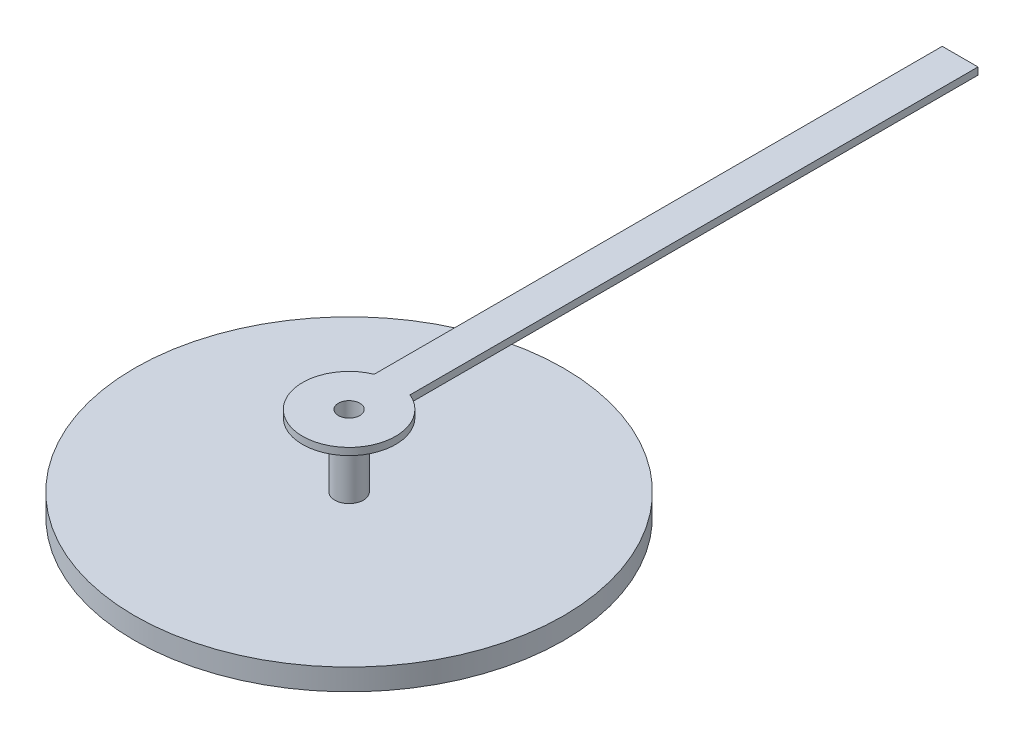
ISO-10303-21;
HEADER;
FILE_DESCRIPTION(('STEP AP214'),'2;1');
FILE_NAME('part.step','',(''),(''),'','','');
FILE_SCHEMA(('AUTOMOTIVE_DESIGN { 1 0 10303 214 1 1 1 1 }'));
ENDSEC;
DATA;
#1=APPLICATION_CONTEXT('core data for automotive mechanical design processes');
#2=APPLICATION_PROTOCOL_DEFINITION('international standard','automotive_design',2000,#1);
#3=PRODUCT_CONTEXT('',#1,'mechanical');
#4=PRODUCT('Part','Part','',(#3));
#5=PRODUCT_RELATED_PRODUCT_CATEGORY('part','',(#4));
#6=PRODUCT_DEFINITION_FORMATION('','',#4);
#7=PRODUCT_DEFINITION_CONTEXT('part definition',#1,'design');
#8=PRODUCT_DEFINITION('design','',#6,#7);
#9=PRODUCT_DEFINITION_SHAPE('','',#8);
#10=(LENGTH_UNIT() NAMED_UNIT(*) SI_UNIT(.MILLI.,.METRE.));
#11=(NAMED_UNIT(*) PLANE_ANGLE_UNIT() SI_UNIT($,.RADIAN.));
#12=(NAMED_UNIT(*) SI_UNIT($,.STERADIAN.) SOLID_ANGLE_UNIT());
#13=UNCERTAINTY_MEASURE_WITH_UNIT(LENGTH_MEASURE(1.E-05),#10,'distance_accuracy_value','');
#14=(GEOMETRIC_REPRESENTATION_CONTEXT(3) GLOBAL_UNCERTAINTY_ASSIGNED_CONTEXT((#13)) GLOBAL_UNIT_ASSIGNED_CONTEXT((#10,
#11,#12)) REPRESENTATION_CONTEXT('',''));
#15=CARTESIAN_POINT('',(0.,0.,0.));
#16=DIRECTION('',(0.,0.,1.));
#17=DIRECTION('',(1.,0.,0.));
#18=AXIS2_PLACEMENT_3D('',#15,#16,#17);
#19=CARTESIAN_POINT('',(0.,0.,0.));
#20=DIRECTION('',(0.,1.,0.));
#21=DIRECTION('',(0.,0.,1.));
#22=AXIS2_PLACEMENT_3D('',#19,#20,#21);
#23=PLANE('',#22);
#24=CARTESIAN_POINT('',(0.,0.,0.));
#25=DIRECTION('',(0.,1.,0.));
#26=DIRECTION('',(0.,0.,1.));
#27=AXIS2_PLACEMENT_3D('',#24,#25,#26);
#28=CIRCLE('',#27,0.651139848707377);
#29=CARTESIAN_POINT('',(-0.25,0.,-0.601234648514759));
#30=VERTEX_POINT('',#29);
#31=CARTESIAN_POINT('',(0.25,0.,-0.601234648514759));
#32=VERTEX_POINT('',#31);
#33=EDGE_CURVE('E104',#30,#32,#28,.T.);
#34=ORIENTED_EDGE('',*,*,#33,.F.);
#35=DIRECTION('',(0.,0.,1.));
#36=VECTOR('',#35,1.);
#37=CARTESIAN_POINT('',(-0.25,0.,-8.54543560573179));
#38=LINE('',#37,#36);
#39=CARTESIAN_POINT('',(-0.25,0.,-8.54543560573179));
#40=VERTEX_POINT('',#39);
#41=EDGE_CURVE('E77',#40,#30,#38,.T.);
#42=ORIENTED_EDGE('',*,*,#41,.F.);
#43=DIRECTION('',(-1.,0.,0.));
#44=VECTOR('',#43,1.);
#45=CARTESIAN_POINT('',(-0.25,0.,-8.54543560573179));
#46=LINE('',#45,#44);
#47=CARTESIAN_POINT('',(0.25,0.,-8.54543560573179));
#48=VERTEX_POINT('',#47);
#49=EDGE_CURVE('E71',#48,#40,#46,.T.);
#50=ORIENTED_EDGE('',*,*,#49,.F.);
#51=DIRECTION('',(0.,0.,-1.));
#52=VECTOR('',#51,1.);
#53=CARTESIAN_POINT('',(0.25,0.,-8.54543560573179));
#54=LINE('',#53,#52);
#55=EDGE_CURVE('E95',#32,#48,#54,.T.);
#56=ORIENTED_EDGE('',*,*,#55,.F.);
#57=EDGE_LOOP('',(#34,#42,#50,#56));
#58=FACE_BOUND('',#57,.T.);
#59=CARTESIAN_POINT('',(0.,0.,0.));
#60=DIRECTION('',(0.,1.,0.));
#61=DIRECTION('',(0.,0.,1.));
#62=AXIS2_PLACEMENT_3D('',#59,#60,#61);
#63=CIRCLE('',#62,0.2);
#64=CARTESIAN_POINT('',(0.,0.,0.2));
#65=VERTEX_POINT('',#64);
#66=EDGE_CURVE('E11',#65,#65,#63,.F.);
#67=ORIENTED_EDGE('',*,*,#66,.F.);
#68=EDGE_LOOP('',(#67));
#69=FACE_BOUND('',#68,.T.);
#70=ADVANCED_FACE('F37',(#58,#69),#23,.F.);
#71=CARTESIAN_POINT('',(0.,0.1,0.));
#72=DIRECTION('',(0.,-1.,0.));
#73=DIRECTION('',(0.,0.,-1.));
#74=AXIS2_PLACEMENT_3D('',#71,#72,#73);
#75=CYLINDRICAL_SURFACE('',#74,0.651139848707377);
#76=ORIENTED_EDGE('',*,*,#33,.T.);
#77=DIRECTION('',(0.,-1.,0.));
#78=VECTOR('',#77,1.);
#79=CARTESIAN_POINT('',(0.25,0.1,-0.601234648514759));
#80=LINE('',#79,#78);
#81=CARTESIAN_POINT('',(0.25,0.1,-0.601234648514759));
#82=VERTEX_POINT('',#81);
#83=EDGE_CURVE('E46',#82,#32,#80,.T.);
#84=ORIENTED_EDGE('',*,*,#83,.F.);
#85=CARTESIAN_POINT('',(0.,0.1,0.));
#86=DIRECTION('',(0.,1.,0.));
#87=DIRECTION('',(0.,0.,1.));
#88=AXIS2_PLACEMENT_3D('',#85,#86,#87);
#89=CIRCLE('',#88,0.651139848707377);
#90=CARTESIAN_POINT('',(-0.25,0.1,-0.601234648514759));
#91=VERTEX_POINT('',#90);
#92=EDGE_CURVE('E90',#91,#82,#89,.T.);
#93=ORIENTED_EDGE('',*,*,#92,.F.);
#94=DIRECTION('',(0.,-1.,0.));
#95=VECTOR('',#94,1.);
#96=CARTESIAN_POINT('',(-0.25,0.1,-0.601234648514759));
#97=LINE('',#96,#95);
#98=EDGE_CURVE('E100',#91,#30,#97,.T.);
#99=ORIENTED_EDGE('',*,*,#98,.T.);
#100=EDGE_LOOP('',(#76,#84,#93,#99));
#101=FACE_BOUND('',#100,.T.);
#102=ADVANCED_FACE('F39',(#101),#75,.T.);
#103=CARTESIAN_POINT('',(0.25,0.1,-8.54543560573179));
#104=DIRECTION('',(-1.,0.,0.));
#105=DIRECTION('',(0.,0.,1.));
#106=AXIS2_PLACEMENT_3D('',#103,#104,#105);
#107=PLANE('',#106);
#108=ORIENTED_EDGE('',*,*,#55,.T.);
#109=DIRECTION('',(0.,-1.,0.));
#110=VECTOR('',#109,1.);
#111=CARTESIAN_POINT('',(0.25,0.1,-8.54543560573179));
#112=LINE('',#111,#110);
#113=CARTESIAN_POINT('',(0.25,0.1,-8.54543560573179));
#114=VERTEX_POINT('',#113);
#115=EDGE_CURVE('E93',#114,#48,#112,.T.);
#116=ORIENTED_EDGE('',*,*,#115,.F.);
#117=DIRECTION('',(0.,0.,-1.));
#118=VECTOR('',#117,1.);
#119=CARTESIAN_POINT('',(0.25,0.1,-8.54543560573179));
#120=LINE('',#119,#118);
#121=EDGE_CURVE('E85',#82,#114,#120,.T.);
#122=ORIENTED_EDGE('',*,*,#121,.F.);
#123=ORIENTED_EDGE('',*,*,#83,.T.);
#124=EDGE_LOOP('',(#108,#116,#122,#123));
#125=FACE_BOUND('',#124,.T.);
#126=ADVANCED_FACE('F94',(#125),#107,.F.);
#127=CARTESIAN_POINT('',(-0.25,0.1,-8.54543560573179));
#128=DIRECTION('',(0.,0.,1.));
#129=DIRECTION('',(1.,0.,0.));
#130=AXIS2_PLACEMENT_3D('',#127,#128,#129);
#131=PLANE('',#130);
#132=ORIENTED_EDGE('',*,*,#49,.T.);
#133=DIRECTION('',(0.,-1.,0.));
#134=VECTOR('',#133,1.);
#135=CARTESIAN_POINT('',(-0.25,0.1,-8.54543560573179));
#136=LINE('',#135,#134);
#137=CARTESIAN_POINT('',(-0.25,0.1,-8.54543560573179));
#138=VERTEX_POINT('',#137);
#139=EDGE_CURVE('E96',#138,#40,#136,.T.);
#140=ORIENTED_EDGE('',*,*,#139,.F.);
#141=DIRECTION('',(-1.,0.,0.));
#142=VECTOR('',#141,1.);
#143=CARTESIAN_POINT('',(-0.25,0.1,-8.54543560573179));
#144=LINE('',#143,#142);
#145=EDGE_CURVE('E88',#114,#138,#144,.T.);
#146=ORIENTED_EDGE('',*,*,#145,.F.);
#147=ORIENTED_EDGE('',*,*,#115,.T.);
#148=EDGE_LOOP('',(#132,#140,#146,#147));
#149=FACE_BOUND('',#148,.T.);
#150=ADVANCED_FACE('F98',(#149),#131,.F.);
#151=CARTESIAN_POINT('',(-0.25,0.1,-8.54543560573179));
#152=DIRECTION('',(1.,0.,0.));
#153=DIRECTION('',(0.,0.,-1.));
#154=AXIS2_PLACEMENT_3D('',#151,#152,#153);
#155=PLANE('',#154);
#156=ORIENTED_EDGE('',*,*,#41,.T.);
#157=ORIENTED_EDGE('',*,*,#98,.F.);
#158=DIRECTION('',(0.,0.,1.));
#159=VECTOR('',#158,1.);
#160=CARTESIAN_POINT('',(-0.25,0.1,-8.54543560573179));
#161=LINE('',#160,#159);
#162=EDGE_CURVE('E54',#138,#91,#161,.T.);
#163=ORIENTED_EDGE('',*,*,#162,.F.);
#164=ORIENTED_EDGE('',*,*,#139,.T.);
#165=EDGE_LOOP('',(#156,#157,#163,#164));
#166=FACE_BOUND('',#165,.T.);
#167=ADVANCED_FACE('F132',(#166),#155,.F.);
#168=CARTESIAN_POINT('',(0.,0.1,0.));
#169=DIRECTION('',(0.,1.,0.));
#170=DIRECTION('',(0.,0.,1.));
#171=AXIS2_PLACEMENT_3D('',#168,#169,#170);
#172=PLANE('',#171);
#173=CARTESIAN_POINT('',(0.,0.1,0.));
#174=DIRECTION('',(0.,1.,0.));
#175=DIRECTION('',(0.,0.,1.));
#176=AXIS2_PLACEMENT_3D('',#173,#174,#175);
#177=CIRCLE('',#176,0.15);
#178=CARTESIAN_POINT('',(0.,0.1,0.15));
#179=VERTEX_POINT('',#178);
#180=EDGE_CURVE('E210',#179,#179,#177,.T.);
#181=ORIENTED_EDGE('',*,*,#180,.F.);
#182=EDGE_LOOP('',(#181));
#183=FACE_BOUND('',#182,.T.);
#184=ORIENTED_EDGE('',*,*,#92,.T.);
#185=ORIENTED_EDGE('',*,*,#121,.T.);
#186=ORIENTED_EDGE('',*,*,#145,.T.);
#187=ORIENTED_EDGE('',*,*,#162,.T.);
#188=EDGE_LOOP('',(#184,#185,#186,#187));
#189=FACE_BOUND('',#188,.T.);
#190=ADVANCED_FACE('F86',(#183,#189),#172,.T.);
#191=CARTESIAN_POINT('',(0.,-0.9,0.));
#192=DIRECTION('',(0.,1.,0.));
#193=DIRECTION('',(0.,0.,1.));
#194=AXIS2_PLACEMENT_3D('',#191,#192,#193);
#195=CYLINDRICAL_SURFACE('',#194,0.2);
#196=CARTESIAN_POINT('',(0.,-0.9,0.));
#197=DIRECTION('',(0.,-1.,0.));
#198=DIRECTION('',(0.,0.,-1.));
#199=AXIS2_PLACEMENT_3D('',#196,#197,#198);
#200=CIRCLE('',#199,0.2);
#201=CARTESIAN_POINT('',(0.,-0.9,-0.2));
#202=VERTEX_POINT('',#201);
#203=EDGE_CURVE('E107',#202,#202,#200,.T.);
#204=ORIENTED_EDGE('',*,*,#203,.F.);
#205=EDGE_LOOP('',(#204));
#206=FACE_BOUND('',#205,.T.);
#207=ORIENTED_EDGE('',*,*,#66,.T.);
#208=EDGE_LOOP('',(#207));
#209=FACE_BOUND('',#208,.T.);
#210=ADVANCED_FACE('F120',(#206,#209),#195,.T.);
#211=CARTESIAN_POINT('',(0.,-0.9,0.));
#212=DIRECTION('',(0.,-1.,0.));
#213=DIRECTION('',(0.,0.,-1.));
#214=AXIS2_PLACEMENT_3D('',#211,#212,#213);
#215=PLANE('',#214);
#216=CARTESIAN_POINT('',(0.,-0.9,0.));
#217=DIRECTION('',(0.,-1.,0.));
#218=DIRECTION('',(0.,0.,-1.));
#219=AXIS2_PLACEMENT_3D('',#216,#217,#218);
#220=CIRCLE('',#219,3.);
#221=CARTESIAN_POINT('',(0.,-0.9,-3.));
#222=VERTEX_POINT('',#221);
#223=EDGE_CURVE('E212',#222,#222,#220,.T.);
#224=ORIENTED_EDGE('',*,*,#223,.F.);
#225=EDGE_LOOP('',(#224));
#226=FACE_BOUND('',#225,.T.);
#227=ORIENTED_EDGE('',*,*,#203,.T.);
#228=EDGE_LOOP('',(#227));
#229=FACE_BOUND('',#228,.T.);
#230=ADVANCED_FACE('F122',(#226,#229),#215,.F.);
#231=CARTESIAN_POINT('',(0.,-1.2,0.));
#232=DIRECTION('',(0.,1.,0.));
#233=DIRECTION('',(0.,0.,1.));
#234=AXIS2_PLACEMENT_3D('',#231,#232,#233);
#235=CYLINDRICAL_SURFACE('',#234,3.);
#236=CARTESIAN_POINT('',(0.,-1.2,0.));
#237=DIRECTION('',(0.,-1.,0.));
#238=DIRECTION('',(0.,0.,-1.));
#239=AXIS2_PLACEMENT_3D('',#236,#237,#238);
#240=CIRCLE('',#239,3.);
#241=CARTESIAN_POINT('',(0.,-1.2,-3.));
#242=VERTEX_POINT('',#241);
#243=EDGE_CURVE('E215',#242,#242,#240,.T.);
#244=ORIENTED_EDGE('',*,*,#243,.F.);
#245=EDGE_LOOP('',(#244));
#246=FACE_BOUND('',#245,.T.);
#247=ORIENTED_EDGE('',*,*,#223,.T.);
#248=EDGE_LOOP('',(#247));
#249=FACE_BOUND('',#248,.T.);
#250=ADVANCED_FACE('F129',(#246,#249),#235,.T.);
#251=CARTESIAN_POINT('',(0.,-1.2,0.));
#252=DIRECTION('',(0.,-1.,0.));
#253=DIRECTION('',(0.,0.,-1.));
#254=AXIS2_PLACEMENT_3D('',#251,#252,#253);
#255=PLANE('',#254);
#256=CARTESIAN_POINT('',(0.,-1.2,0.));
#257=DIRECTION('',(0.,1.,0.));
#258=DIRECTION('',(0.,0.,1.));
#259=AXIS2_PLACEMENT_3D('',#256,#257,#258);
#260=CIRCLE('',#259,0.15);
#261=CARTESIAN_POINT('',(0.,-1.2,0.15));
#262=VERTEX_POINT('',#261);
#263=EDGE_CURVE('E207',#262,#262,#260,.T.);
#264=ORIENTED_EDGE('',*,*,#263,.T.);
#265=EDGE_LOOP('',(#264));
#266=FACE_BOUND('',#265,.T.);
#267=ORIENTED_EDGE('',*,*,#243,.T.);
#268=EDGE_LOOP('',(#267));
#269=FACE_BOUND('',#268,.T.);
#270=ADVANCED_FACE('F175',(#266,#269),#255,.T.);
#271=CARTESIAN_POINT('',(0.,-1.2,0.));
#272=DIRECTION('',(0.,1.,0.));
#273=DIRECTION('',(0.,0.,1.));
#274=AXIS2_PLACEMENT_3D('',#271,#272,#273);
#275=CYLINDRICAL_SURFACE('',#274,0.15);
#276=ORIENTED_EDGE('',*,*,#263,.F.);
#277=EDGE_LOOP('',(#276));
#278=FACE_BOUND('',#277,.T.);
#279=ORIENTED_EDGE('',*,*,#180,.T.);
#280=EDGE_LOOP('',(#279));
#281=FACE_BOUND('',#280,.T.);
#282=ADVANCED_FACE('F190',(#278,#281),#275,.F.);
#283=CLOSED_SHELL('',(#70,#102,#126,#150,#167,#190,#210,#230,#250,#270,#282));
#284=MANIFOLD_SOLID_BREP('B2',#283);
#285=ADVANCED_BREP_SHAPE_REPRESENTATION('',(#18,#284),#14);
#286=SHAPE_DEFINITION_REPRESENTATION(#9,#285);
ENDSEC;
END-ISO-10303-21;
